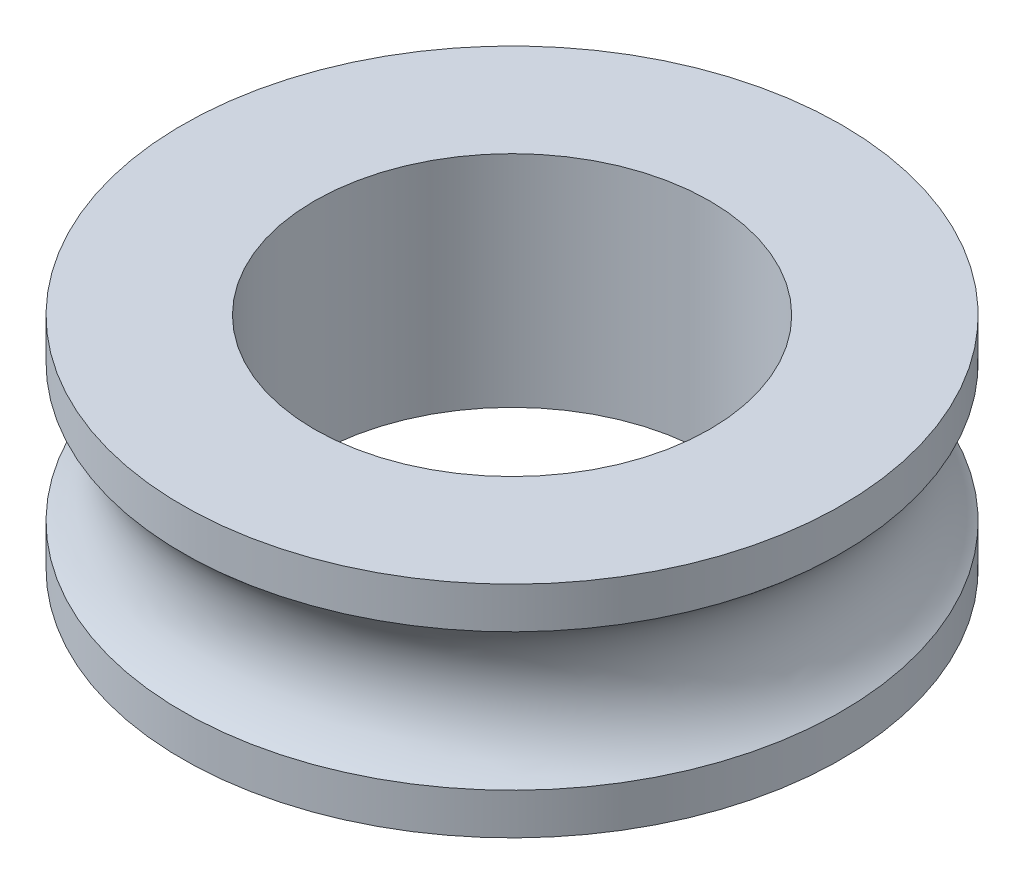
ISO-10303-21;
HEADER;
FILE_DESCRIPTION(('STEP AP214'),'2;1');
FILE_NAME('part.step','',(''),(''),'','','');
FILE_SCHEMA(('AUTOMOTIVE_DESIGN { 1 0 10303 214 1 1 1 1 }'));
ENDSEC;
DATA;
#1=APPLICATION_CONTEXT('core data for automotive mechanical design processes');
#2=APPLICATION_PROTOCOL_DEFINITION('international standard','automotive_design',2000,#1);
#3=PRODUCT_CONTEXT('',#1,'mechanical');
#4=PRODUCT('Part','Part','',(#3));
#5=PRODUCT_RELATED_PRODUCT_CATEGORY('part','',(#4));
#6=PRODUCT_DEFINITION_FORMATION('','',#4);
#7=PRODUCT_DEFINITION_CONTEXT('part definition',#1,'design');
#8=PRODUCT_DEFINITION('design','',#6,#7);
#9=PRODUCT_DEFINITION_SHAPE('','',#8);
#10=(LENGTH_UNIT() NAMED_UNIT(*) SI_UNIT(.MILLI.,.METRE.));
#11=(NAMED_UNIT(*) PLANE_ANGLE_UNIT() SI_UNIT($,.RADIAN.));
#12=(NAMED_UNIT(*) SI_UNIT($,.STERADIAN.) SOLID_ANGLE_UNIT());
#13=UNCERTAINTY_MEASURE_WITH_UNIT(LENGTH_MEASURE(1.E-05),#10,'distance_accuracy_value','');
#14=(GEOMETRIC_REPRESENTATION_CONTEXT(3) GLOBAL_UNCERTAINTY_ASSIGNED_CONTEXT((#13)) GLOBAL_UNIT_ASSIGNED_CONTEXT((#10,
#11,#12)) REPRESENTATION_CONTEXT('',''));
#15=CARTESIAN_POINT('',(0.,0.,0.));
#16=DIRECTION('',(0.,0.,1.));
#17=DIRECTION('',(1.,0.,0.));
#18=AXIS2_PLACEMENT_3D('',#15,#16,#17);
#19=CARTESIAN_POINT('',(0.,0.,0.));
#20=DIRECTION('',(0.,-1.,0.));
#21=DIRECTION('',(0.,0.,-1.));
#22=AXIS2_PLACEMENT_3D('',#19,#20,#21);
#23=CYLINDRICAL_SURFACE('',#22,1.5);
#24=CARTESIAN_POINT('',(0.,-0.31224989991992,0.));
#25=DIRECTION('',(0.,-1.,0.));
#26=DIRECTION('',(0.,0.,-1.));
#27=AXIS2_PLACEMENT_3D('',#24,#25,#26);
#28=CIRCLE('',#27,1.5);
#29=CARTESIAN_POINT('',(0.,-0.31224989991992,-1.5));
#30=VERTEX_POINT('',#29);
#31=EDGE_CURVE('E10',#30,#30,#28,.T.);
#32=ORIENTED_EDGE('',*,*,#31,.T.);
#33=EDGE_LOOP('',(#32));
#34=FACE_BOUND('',#33,.T.);
#35=CARTESIAN_POINT('',(0.,-0.5,0.));
#36=DIRECTION('',(0.,-1.,0.));
#37=DIRECTION('',(0.,0.,-1.));
#38=AXIS2_PLACEMENT_3D('',#35,#36,#37);
#39=CIRCLE('',#38,1.5);
#40=CARTESIAN_POINT('',(0.,-0.5,-1.5));
#41=VERTEX_POINT('',#40);
#42=EDGE_CURVE('E44',#41,#41,#39,.T.);
#43=ORIENTED_EDGE('',*,*,#42,.F.);
#44=EDGE_LOOP('',(#43));
#45=FACE_BOUND('',#44,.T.);
#46=ADVANCED_FACE('F30',(#34,#45),#23,.T.);
#47=CARTESIAN_POINT('',(0.,0.,0.));
#48=DIRECTION('',(0.,-1.,0.));
#49=DIRECTION('',(0.,0.,-1.));
#50=AXIS2_PLACEMENT_3D('',#47,#48,#49);
#51=TOROIDAL_SURFACE('',#50,1.75,0.4);
#52=CARTESIAN_POINT('',(0.,0.31224989991992,0.));
#53=DIRECTION('',(0.,-1.,0.));
#54=DIRECTION('',(0.,0.,-1.));
#55=AXIS2_PLACEMENT_3D('',#52,#53,#54);
#56=CIRCLE('',#55,1.5);
#57=CARTESIAN_POINT('',(0.,0.31224989991992,-1.5));
#58=VERTEX_POINT('',#57);
#59=EDGE_CURVE('E36',#58,#58,#56,.T.);
#60=ORIENTED_EDGE('',*,*,#59,.T.);
#61=EDGE_LOOP('',(#60));
#62=FACE_BOUND('',#61,.T.);
#63=ORIENTED_EDGE('',*,*,#31,.F.);
#64=EDGE_LOOP('',(#63));
#65=FACE_BOUND('',#64,.T.);
#66=ADVANCED_FACE('F74',(#62,#65),#51,.F.);
#67=CARTESIAN_POINT('',(0.,0.,0.));
#68=DIRECTION('',(0.,-1.,0.));
#69=DIRECTION('',(0.,0.,-1.));
#70=AXIS2_PLACEMENT_3D('',#67,#68,#69);
#71=CYLINDRICAL_SURFACE('',#70,1.5);
#72=CARTESIAN_POINT('',(0.,0.5,0.));
#73=DIRECTION('',(0.,-1.,0.));
#74=DIRECTION('',(0.,0.,-1.));
#75=AXIS2_PLACEMENT_3D('',#72,#73,#74);
#76=CIRCLE('',#75,1.5);
#77=CARTESIAN_POINT('',(0.,0.5,-1.5));
#78=VERTEX_POINT('',#77);
#79=EDGE_CURVE('E40',#78,#78,#76,.T.);
#80=ORIENTED_EDGE('',*,*,#79,.T.);
#81=EDGE_LOOP('',(#80));
#82=FACE_BOUND('',#81,.T.);
#83=ORIENTED_EDGE('',*,*,#59,.F.);
#84=EDGE_LOOP('',(#83));
#85=FACE_BOUND('',#84,.T.);
#86=ADVANCED_FACE('F68',(#82,#85),#71,.T.);
#87=CARTESIAN_POINT('',(0.,0.5,0.));
#88=DIRECTION('',(0.,1.,0.));
#89=DIRECTION('',(0.,0.,1.));
#90=AXIS2_PLACEMENT_3D('',#87,#88,#89);
#91=PLANE('',#90);
#92=CARTESIAN_POINT('',(0.,0.5,0.));
#93=DIRECTION('',(0.,1.,0.));
#94=DIRECTION('',(0.,0.,1.));
#95=AXIS2_PLACEMENT_3D('',#92,#93,#94);
#96=CIRCLE('',#95,0.9);
#97=CARTESIAN_POINT('',(0.,0.5,0.9));
#98=VERTEX_POINT('',#97);
#99=EDGE_CURVE('E50',#98,#98,#96,.T.);
#100=ORIENTED_EDGE('',*,*,#99,.F.);
#101=EDGE_LOOP('',(#100));
#102=FACE_BOUND('',#101,.T.);
#103=ORIENTED_EDGE('',*,*,#79,.F.);
#104=EDGE_LOOP('',(#103));
#105=FACE_BOUND('',#104,.T.);
#106=ADVANCED_FACE('F65',(#102,#105),#91,.T.);
#107=CARTESIAN_POINT('',(1.5,-0.5,0.));
#108=DIRECTION('',(0.,-1.,0.));
#109=DIRECTION('',(0.,0.,-1.));
#110=AXIS2_PLACEMENT_3D('',#107,#108,#109);
#111=PLANE('',#110);
#112=CARTESIAN_POINT('',(0.,-0.5,0.));
#113=DIRECTION('',(0.,1.,0.));
#114=DIRECTION('',(0.,0.,1.));
#115=AXIS2_PLACEMENT_3D('',#112,#113,#114);
#116=CIRCLE('',#115,0.9);
#117=CARTESIAN_POINT('',(0.,-0.5,0.9));
#118=VERTEX_POINT('',#117);
#119=EDGE_CURVE('E49',#118,#118,#116,.T.);
#120=ORIENTED_EDGE('',*,*,#119,.T.);
#121=EDGE_LOOP('',(#120));
#122=FACE_BOUND('',#121,.T.);
#123=ORIENTED_EDGE('',*,*,#42,.T.);
#124=EDGE_LOOP('',(#123));
#125=FACE_BOUND('',#124,.T.);
#126=ADVANCED_FACE('F56',(#122,#125),#111,.T.);
#127=CARTESIAN_POINT('',(0.,-0.5,0.));
#128=DIRECTION('',(0.,1.,0.));
#129=DIRECTION('',(0.,0.,1.));
#130=AXIS2_PLACEMENT_3D('',#127,#128,#129);
#131=CYLINDRICAL_SURFACE('',#130,0.9);
#132=ORIENTED_EDGE('',*,*,#119,.F.);
#133=EDGE_LOOP('',(#132));
#134=FACE_BOUND('',#133,.T.);
#135=ORIENTED_EDGE('',*,*,#99,.T.);
#136=EDGE_LOOP('',(#135));
#137=FACE_BOUND('',#136,.T.);
#138=ADVANCED_FACE('F59',(#134,#137),#131,.F.);
#139=CLOSED_SHELL('',(#46,#66,#86,#106,#126,#138));
#140=MANIFOLD_SOLID_BREP('B2',#139);
#141=ADVANCED_BREP_SHAPE_REPRESENTATION('',(#18,#140),#14);
#142=SHAPE_DEFINITION_REPRESENTATION(#9,#141);
ENDSEC;
END-ISO-10303-21;
